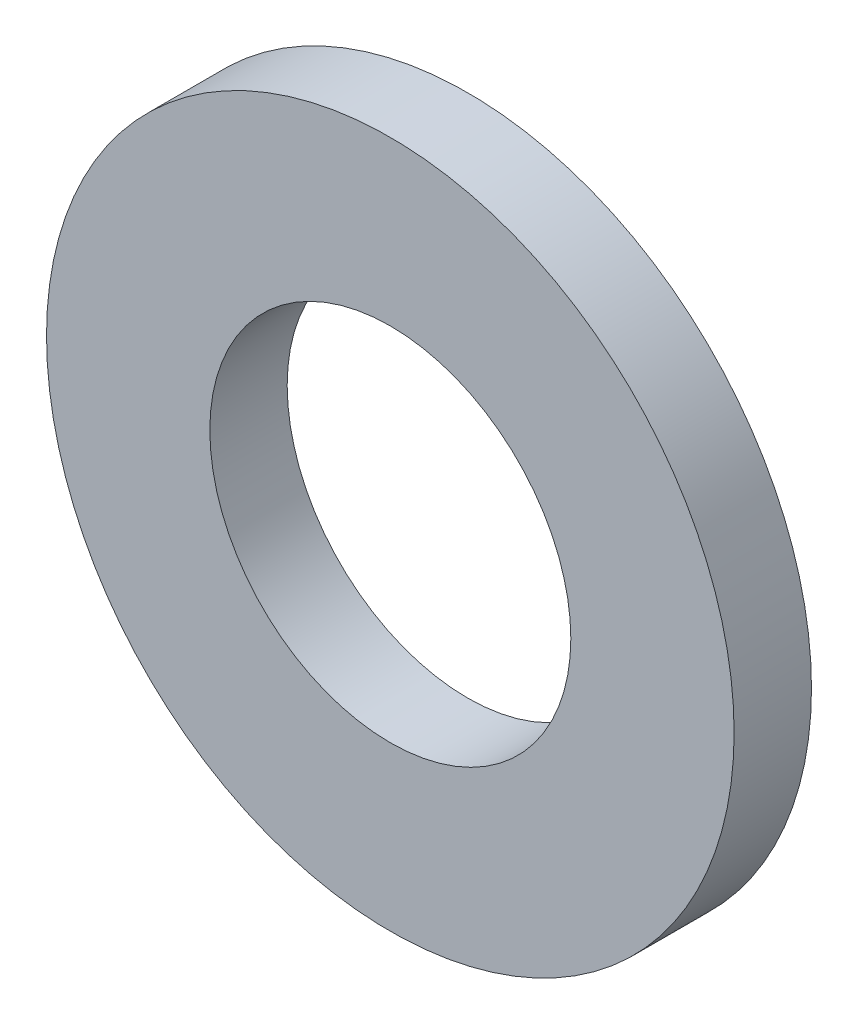
ISO-10303-21;
HEADER;
FILE_DESCRIPTION(('STEP AP214'),'2;1');
FILE_NAME('part.step','',(''),(''),'','','');
FILE_SCHEMA(('AUTOMOTIVE_DESIGN { 1 0 10303 214 1 1 1 1 }'));
ENDSEC;
DATA;
#1=APPLICATION_CONTEXT('core data for automotive mechanical design processes');
#2=APPLICATION_PROTOCOL_DEFINITION('international standard','automotive_design',2000,#1);
#3=PRODUCT_CONTEXT('',#1,'mechanical');
#4=PRODUCT('Part','Part','',(#3));
#5=PRODUCT_RELATED_PRODUCT_CATEGORY('part','',(#4));
#6=PRODUCT_DEFINITION_FORMATION('','',#4);
#7=PRODUCT_DEFINITION_CONTEXT('part definition',#1,'design');
#8=PRODUCT_DEFINITION('design','',#6,#7);
#9=PRODUCT_DEFINITION_SHAPE('','',#8);
#10=(LENGTH_UNIT() NAMED_UNIT(*) SI_UNIT(.MILLI.,.METRE.));
#11=(NAMED_UNIT(*) PLANE_ANGLE_UNIT() SI_UNIT($,.RADIAN.));
#12=(NAMED_UNIT(*) SI_UNIT($,.STERADIAN.) SOLID_ANGLE_UNIT());
#13=UNCERTAINTY_MEASURE_WITH_UNIT(LENGTH_MEASURE(1.E-05),#10,'distance_accuracy_value','');
#14=(GEOMETRIC_REPRESENTATION_CONTEXT(3) GLOBAL_UNCERTAINTY_ASSIGNED_CONTEXT((#13)) GLOBAL_UNIT_ASSIGNED_CONTEXT((#10,
#11,#12)) REPRESENTATION_CONTEXT('',''));
#15=CARTESIAN_POINT('',(0.,0.,0.));
#16=DIRECTION('',(0.,0.,1.));
#17=DIRECTION('',(1.,0.,0.));
#18=AXIS2_PLACEMENT_3D('',#15,#16,#17);
#19=CARTESIAN_POINT('',(0.,0.,1.8));
#20=DIRECTION('',(0.,0.,1.));
#21=DIRECTION('',(1.,0.,0.));
#22=AXIS2_PLACEMENT_3D('',#19,#20,#21);
#23=PLANE('',#22);
#24=CARTESIAN_POINT('',(0.,0.,1.8));
#25=DIRECTION('',(0.,0.,1.));
#26=DIRECTION('',(1.,0.,0.));
#27=AXIS2_PLACEMENT_3D('',#24,#25,#26);
#28=CIRCLE('',#27,8.);
#29=CARTESIAN_POINT('',(8.,0.,1.8));
#30=VERTEX_POINT('',#29);
#31=EDGE_CURVE('E10',#30,#30,#28,.T.);
#32=ORIENTED_EDGE('',*,*,#31,.T.);
#33=EDGE_LOOP('',(#32));
#34=FACE_BOUND('',#33,.T.);
#35=CARTESIAN_POINT('',(0.,0.,1.8));
#36=DIRECTION('',(0.,0.,1.));
#37=DIRECTION('',(1.,0.,0.));
#38=AXIS2_PLACEMENT_3D('',#35,#36,#37);
#39=CIRCLE('',#38,4.2);
#40=CARTESIAN_POINT('',(4.2,0.,1.8));
#41=VERTEX_POINT('',#40);
#42=EDGE_CURVE('E43',#41,#41,#39,.T.);
#43=ORIENTED_EDGE('',*,*,#42,.F.);
#44=EDGE_LOOP('',(#43));
#45=FACE_BOUND('',#44,.T.);
#46=ADVANCED_FACE('F32',(#34,#45),#23,.T.);
#47=CARTESIAN_POINT('',(0.,0.,0.));
#48=DIRECTION('',(0.,0.,1.));
#49=DIRECTION('',(1.,0.,0.));
#50=AXIS2_PLACEMENT_3D('',#47,#48,#49);
#51=PLANE('',#50);
#52=CARTESIAN_POINT('',(0.,0.,0.));
#53=DIRECTION('',(0.,0.,1.));
#54=DIRECTION('',(1.,0.,0.));
#55=AXIS2_PLACEMENT_3D('',#52,#53,#54);
#56=CIRCLE('',#55,8.);
#57=CARTESIAN_POINT('',(8.,0.,0.));
#58=VERTEX_POINT('',#57);
#59=EDGE_CURVE('E36',#58,#58,#56,.T.);
#60=ORIENTED_EDGE('',*,*,#59,.F.);
#61=EDGE_LOOP('',(#60));
#62=FACE_BOUND('',#61,.T.);
#63=CARTESIAN_POINT('',(0.,0.,0.));
#64=DIRECTION('',(0.,0.,1.));
#65=DIRECTION('',(1.,0.,0.));
#66=AXIS2_PLACEMENT_3D('',#63,#64,#65);
#67=CIRCLE('',#66,4.2);
#68=CARTESIAN_POINT('',(4.2,0.,0.));
#69=VERTEX_POINT('',#68);
#70=EDGE_CURVE('E45',#69,#69,#67,.T.);
#71=ORIENTED_EDGE('',*,*,#70,.T.);
#72=EDGE_LOOP('',(#71));
#73=FACE_BOUND('',#72,.T.);
#74=ADVANCED_FACE('F56',(#62,#73),#51,.F.);
#75=CARTESIAN_POINT('',(0.,0.,1.8));
#76=DIRECTION('',(0.,0.,-1.));
#77=DIRECTION('',(-1.,0.,0.));
#78=AXIS2_PLACEMENT_3D('',#75,#76,#77);
#79=CYLINDRICAL_SURFACE('',#78,8.);
#80=ORIENTED_EDGE('',*,*,#31,.F.);
#81=EDGE_LOOP('',(#80));
#82=FACE_BOUND('',#81,.T.);
#83=ORIENTED_EDGE('',*,*,#59,.T.);
#84=EDGE_LOOP('',(#83));
#85=FACE_BOUND('',#84,.T.);
#86=ADVANCED_FACE('F34',(#82,#85),#79,.T.);
#87=CARTESIAN_POINT('',(0.,0.,1.8));
#88=DIRECTION('',(0.,0.,-1.));
#89=DIRECTION('',(-1.,0.,0.));
#90=AXIS2_PLACEMENT_3D('',#87,#88,#89);
#91=CYLINDRICAL_SURFACE('',#90,4.2);
#92=ORIENTED_EDGE('',*,*,#42,.T.);
#93=EDGE_LOOP('',(#92));
#94=FACE_BOUND('',#93,.T.);
#95=ORIENTED_EDGE('',*,*,#70,.F.);
#96=EDGE_LOOP('',(#95));
#97=FACE_BOUND('',#96,.T.);
#98=ADVANCED_FACE('F52',(#94,#97),#91,.F.);
#99=CLOSED_SHELL('',(#46,#74,#86,#98));
#100=MANIFOLD_SOLID_BREP('B2',#99);
#101=ADVANCED_BREP_SHAPE_REPRESENTATION('',(#18,#100),#14);
#102=SHAPE_DEFINITION_REPRESENTATION(#9,#101);
ENDSEC;
END-ISO-10303-21;
